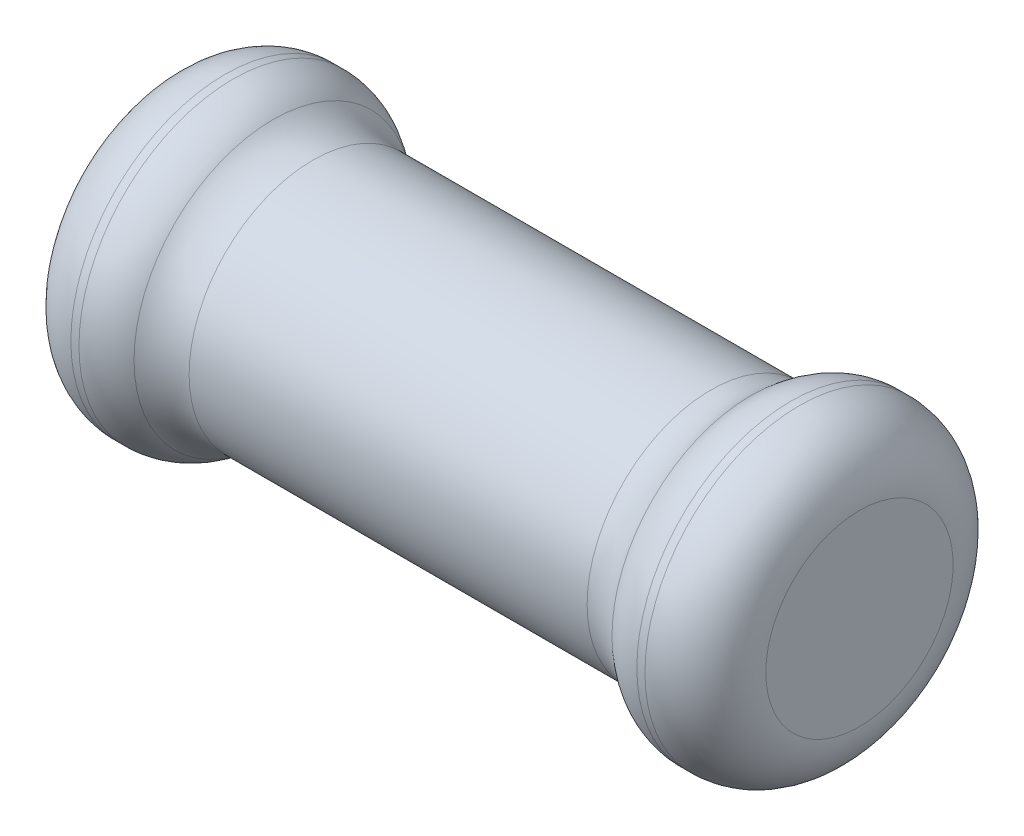
ISO-10303-21;
HEADER;
FILE_DESCRIPTION(('STEP AP214'),'2;1');
FILE_NAME('part.step','',(''),(''),'','','');
FILE_SCHEMA(('AUTOMOTIVE_DESIGN { 1 0 10303 214 1 1 1 1 }'));
ENDSEC;
DATA;
#1=APPLICATION_CONTEXT('core data for automotive mechanical design processes');
#2=APPLICATION_PROTOCOL_DEFINITION('international standard','automotive_design',2000,#1);
#3=PRODUCT_CONTEXT('',#1,'mechanical');
#4=PRODUCT('Part','Part','',(#3));
#5=PRODUCT_RELATED_PRODUCT_CATEGORY('part','',(#4));
#6=PRODUCT_DEFINITION_FORMATION('','',#4);
#7=PRODUCT_DEFINITION_CONTEXT('part definition',#1,'design');
#8=PRODUCT_DEFINITION('design','',#6,#7);
#9=PRODUCT_DEFINITION_SHAPE('','',#8);
#10=(LENGTH_UNIT() NAMED_UNIT(*) SI_UNIT(.MILLI.,.METRE.));
#11=(NAMED_UNIT(*) PLANE_ANGLE_UNIT() SI_UNIT($,.RADIAN.));
#12=(NAMED_UNIT(*) SI_UNIT($,.STERADIAN.) SOLID_ANGLE_UNIT());
#13=UNCERTAINTY_MEASURE_WITH_UNIT(LENGTH_MEASURE(1.E-05),#10,'distance_accuracy_value','');
#14=(GEOMETRIC_REPRESENTATION_CONTEXT(3) GLOBAL_UNCERTAINTY_ASSIGNED_CONTEXT((#13)) GLOBAL_UNIT_ASSIGNED_CONTEXT((#10,
#11,#12)) REPRESENTATION_CONTEXT('',''));
#15=CARTESIAN_POINT('',(0.,0.,0.));
#16=DIRECTION('',(0.,0.,1.));
#17=DIRECTION('',(1.,0.,0.));
#18=AXIS2_PLACEMENT_3D('',#15,#16,#17);
#19=CARTESIAN_POINT('',(5.75,0.,0.));
#20=DIRECTION('',(1.,0.,0.));
#21=DIRECTION('',(0.,1.,0.));
#22=AXIS2_PLACEMENT_3D('',#19,#20,#21);
#23=PLANE('',#22);
#24=CARTESIAN_POINT('',(5.75,0.,0.));
#25=DIRECTION('',(-1.,0.,0.));
#26=DIRECTION('',(0.,-1.,0.));
#27=AXIS2_PLACEMENT_3D('',#24,#25,#26);
#28=CIRCLE('',#27,1.55);
#29=CARTESIAN_POINT('',(5.75,1.55,0.));
#30=VERTEX_POINT('',#29);
#31=CARTESIAN_POINT('',(5.75,0.,1.55));
#32=VERTEX_POINT('',#31);
#33=EDGE_CURVE('E199',#30,#32,#28,.T.);
#34=ORIENTED_EDGE('',*,*,#33,.F.);
#35=CARTESIAN_POINT('',(5.75,0.,0.));
#36=DIRECTION('',(-1.,0.,0.));
#37=DIRECTION('',(0.,-1.,0.));
#38=AXIS2_PLACEMENT_3D('',#35,#36,#37);
#39=CIRCLE('',#38,1.55);
#40=EDGE_CURVE('E10',#32,#30,#39,.T.);
#41=ORIENTED_EDGE('',*,*,#40,.F.);
#42=EDGE_LOOP('',(#34,#41));
#43=FACE_BOUND('',#42,.T.);
#44=ADVANCED_FACE('F16',(#43),#23,.T.);
#45=CARTESIAN_POINT('',(4.75,0.,0.));
#46=DIRECTION('',(1.,0.,0.));
#47=DIRECTION('',(0.,0.,-1.));
#48=AXIS2_PLACEMENT_3D('',#45,#46,#47);
#49=TOROIDAL_SURFACE('',#48,1.55,1.);
#50=ORIENTED_EDGE('',*,*,#33,.T.);
#51=CARTESIAN_POINT('',(4.75,0.,1.55));
#52=DIRECTION('',(0.,-1.,0.));
#53=DIRECTION('',(0.,0.,1.));
#54=AXIS2_PLACEMENT_3D('',#51,#52,#53);
#55=CIRCLE('',#54,1.);
#56=CARTESIAN_POINT('',(4.75,0.,2.55));
#57=VERTEX_POINT('',#56);
#58=EDGE_CURVE('E26',#32,#57,#55,.T.);
#59=ORIENTED_EDGE('',*,*,#58,.T.);
#60=CARTESIAN_POINT('',(4.75,0.,0.));
#61=DIRECTION('',(1.,0.,0.));
#62=DIRECTION('',(0.,-1.,0.));
#63=AXIS2_PLACEMENT_3D('',#60,#61,#62);
#64=CIRCLE('',#63,2.55);
#65=CARTESIAN_POINT('',(4.75,-2.55,0.));
#66=VERTEX_POINT('',#65);
#67=EDGE_CURVE('E193',#57,#66,#64,.T.);
#68=ORIENTED_EDGE('',*,*,#67,.T.);
#69=CARTESIAN_POINT('',(4.75,0.,0.));
#70=DIRECTION('',(1.,0.,0.));
#71=DIRECTION('',(0.,-1.,0.));
#72=AXIS2_PLACEMENT_3D('',#69,#70,#71);
#73=CIRCLE('',#72,2.55);
#74=CARTESIAN_POINT('',(4.75,2.55,0.));
#75=VERTEX_POINT('',#74);
#76=EDGE_CURVE('E185',#66,#75,#73,.T.);
#77=ORIENTED_EDGE('',*,*,#76,.T.);
#78=CARTESIAN_POINT('',(4.75,0.,0.));
#79=DIRECTION('',(1.,0.,0.));
#80=DIRECTION('',(0.,-1.,0.));
#81=AXIS2_PLACEMENT_3D('',#78,#79,#80);
#82=CIRCLE('',#81,2.55);
#83=EDGE_CURVE('E181',#75,#57,#82,.T.);
#84=ORIENTED_EDGE('',*,*,#83,.T.);
#85=ORIENTED_EDGE('',*,*,#58,.F.);
#86=ORIENTED_EDGE('',*,*,#40,.T.);
#87=EDGE_LOOP('',(#50,#59,#68,#77,#84,#85,#86));
#88=FACE_BOUND('',#87,.T.);
#89=ADVANCED_FACE('F256',(#88),#49,.T.);
#90=CARTESIAN_POINT('',(4.75,0.,0.));
#91=DIRECTION('',(1.,0.,0.));
#92=DIRECTION('',(0.,1.,0.));
#93=AXIS2_PLACEMENT_3D('',#90,#91,#92);
#94=CYLINDRICAL_SURFACE('',#93,2.55);
#95=ORIENTED_EDGE('',*,*,#83,.F.);
#96=ORIENTED_EDGE('',*,*,#76,.F.);
#97=DIRECTION('',(-1.,0.,0.));
#98=VECTOR('',#97,1.);
#99=CARTESIAN_POINT('',(4.75,-2.55,0.));
#100=LINE('',#99,#98);
#101=CARTESIAN_POINT('',(4.616025403784,-2.55,0.));
#102=VERTEX_POINT('',#101);
#103=EDGE_CURVE('E190',#66,#102,#100,.T.);
#104=ORIENTED_EDGE('',*,*,#103,.T.);
#105=CARTESIAN_POINT('',(4.616025403784,0.,0.));
#106=DIRECTION('',(-1.,0.,0.));
#107=DIRECTION('',(0.,1.,0.));
#108=AXIS2_PLACEMENT_3D('',#105,#106,#107);
#109=CIRCLE('',#108,2.55);
#110=EDGE_CURVE('E171',#102,#102,#109,.T.);
#111=ORIENTED_EDGE('',*,*,#110,.F.);
#112=ORIENTED_EDGE('',*,*,#103,.F.);
#113=ORIENTED_EDGE('',*,*,#67,.F.);
#114=EDGE_LOOP('',(#95,#96,#104,#111,#112,#113));
#115=FACE_BOUND('',#114,.T.);
#116=ADVANCED_FACE('F261',(#115),#94,.T.);
#117=CARTESIAN_POINT('',(4.616025403784,0.,0.));
#118=DIRECTION('',(1.,0.,0.));
#119=DIRECTION('',(0.,1.,0.));
#120=AXIS2_PLACEMENT_3D('',#117,#118,#119);
#121=TOROIDAL_SURFACE('',#120,1.55,1.);
#122=ORIENTED_EDGE('',*,*,#110,.T.);
#123=CARTESIAN_POINT('',(4.616025403784,-1.55,0.));
#124=DIRECTION('',(0.,0.,-1.));
#125=DIRECTION('',(0.,-1.,0.));
#126=AXIS2_PLACEMENT_3D('',#123,#124,#125);
#127=CIRCLE('',#126,1.);
#128=CARTESIAN_POINT('',(3.954587576018,-2.3,0.));
#129=VERTEX_POINT('',#128);
#130=EDGE_CURVE('E108',#102,#129,#127,.T.);
#131=ORIENTED_EDGE('',*,*,#130,.T.);
#132=CARTESIAN_POINT('',(3.954587576018,0.,0.));
#133=DIRECTION('',(-1.,0.,0.));
#134=DIRECTION('',(0.,1.,0.));
#135=AXIS2_PLACEMENT_3D('',#132,#133,#134);
#136=CIRCLE('',#135,2.3);
#137=CARTESIAN_POINT('',(3.954587576018,0.,2.3));
#138=VERTEX_POINT('',#137);
#139=EDGE_CURVE('E189',#138,#129,#136,.T.);
#140=ORIENTED_EDGE('',*,*,#139,.F.);
#141=CARTESIAN_POINT('',(3.954587576018,0.,0.));
#142=DIRECTION('',(-1.,0.,0.));
#143=DIRECTION('',(0.,1.,0.));
#144=AXIS2_PLACEMENT_3D('',#141,#142,#143);
#145=CIRCLE('',#144,2.3);
#146=EDGE_CURVE('E120',#129,#138,#145,.T.);
#147=ORIENTED_EDGE('',*,*,#146,.F.);
#148=ORIENTED_EDGE('',*,*,#130,.F.);
#149=EDGE_LOOP('',(#122,#131,#140,#147,#148));
#150=FACE_BOUND('',#149,.T.);
#151=ADVANCED_FACE('F271',(#150),#121,.T.);
#152=CARTESIAN_POINT('',(-4.616025403784,0.,0.));
#153=DIRECTION('',(-1.,0.,0.));
#154=DIRECTION('',(0.,1.,0.));
#155=AXIS2_PLACEMENT_3D('',#152,#153,#154);
#156=TOROIDAL_SURFACE('',#155,1.55,1.);
#157=CARTESIAN_POINT('',(-4.616025403784,0.,0.));
#158=DIRECTION('',(1.,0.,0.));
#159=DIRECTION('',(0.,1.,0.));
#160=AXIS2_PLACEMENT_3D('',#157,#158,#159);
#161=CIRCLE('',#160,2.55);
#162=CARTESIAN_POINT('',(-4.616025403784,-2.55,0.));
#163=VERTEX_POINT('',#162);
#164=EDGE_CURVE('E226',#163,#163,#161,.T.);
#165=ORIENTED_EDGE('',*,*,#164,.T.);
#166=CARTESIAN_POINT('',(-4.616025403784,-1.55,0.));
#167=DIRECTION('',(0.,0.,1.));
#168=DIRECTION('',(0.,-1.,0.));
#169=AXIS2_PLACEMENT_3D('',#166,#167,#168);
#170=CIRCLE('',#169,1.);
#171=CARTESIAN_POINT('',(-3.954587576018,-2.3,0.));
#172=VERTEX_POINT('',#171);
#173=EDGE_CURVE('E174',#163,#172,#170,.T.);
#174=ORIENTED_EDGE('',*,*,#173,.T.);
#175=CARTESIAN_POINT('',(-3.954587576018,0.,0.));
#176=DIRECTION('',(1.,0.,0.));
#177=DIRECTION('',(0.,-1.,0.));
#178=AXIS2_PLACEMENT_3D('',#175,#176,#177);
#179=CIRCLE('',#178,2.3);
#180=CARTESIAN_POINT('',(-3.954587576018,0.,2.3));
#181=VERTEX_POINT('',#180);
#182=EDGE_CURVE('E147',#181,#172,#179,.T.);
#183=ORIENTED_EDGE('',*,*,#182,.F.);
#184=CARTESIAN_POINT('',(-3.954587576018,0.,0.));
#185=DIRECTION('',(1.,0.,0.));
#186=DIRECTION('',(0.,-1.,0.));
#187=AXIS2_PLACEMENT_3D('',#184,#185,#186);
#188=CIRCLE('',#187,2.3);
#189=CARTESIAN_POINT('',(-3.954587576018,2.3,0.));
#190=VERTEX_POINT('',#189);
#191=EDGE_CURVE('E145',#190,#181,#188,.T.);
#192=ORIENTED_EDGE('',*,*,#191,.F.);
#193=CARTESIAN_POINT('',(-3.954587576018,0.,0.));
#194=DIRECTION('',(1.,0.,0.));
#195=DIRECTION('',(0.,-1.,0.));
#196=AXIS2_PLACEMENT_3D('',#193,#194,#195);
#197=CIRCLE('',#196,2.3);
#198=EDGE_CURVE('E142',#172,#190,#197,.T.);
#199=ORIENTED_EDGE('',*,*,#198,.F.);
#200=ORIENTED_EDGE('',*,*,#173,.F.);
#201=EDGE_LOOP('',(#165,#174,#183,#192,#199,#200));
#202=FACE_BOUND('',#201,.T.);
#203=ADVANCED_FACE('F154',(#202),#156,.T.);
#204=CARTESIAN_POINT('',(-5.75,2.55,0.));
#205=DIRECTION('',(-1.,0.,0.));
#206=DIRECTION('',(0.,0.,1.));
#207=AXIS2_PLACEMENT_3D('',#204,#205,#206);
#208=PLANE('',#207);
#209=CARTESIAN_POINT('',(-5.75,0.,0.));
#210=DIRECTION('',(1.,0.,0.));
#211=DIRECTION('',(0.,-1.,0.));
#212=AXIS2_PLACEMENT_3D('',#209,#210,#211);
#213=CIRCLE('',#212,1.55);
#214=CARTESIAN_POINT('',(-5.75,1.55,0.));
#215=VERTEX_POINT('',#214);
#216=CARTESIAN_POINT('',(-5.75,0.,1.55));
#217=VERTEX_POINT('',#216);
#218=EDGE_CURVE('E205',#215,#217,#213,.T.);
#219=ORIENTED_EDGE('',*,*,#218,.F.);
#220=CARTESIAN_POINT('',(-5.75,0.,0.));
#221=DIRECTION('',(1.,0.,0.));
#222=DIRECTION('',(0.,-1.,0.));
#223=AXIS2_PLACEMENT_3D('',#220,#221,#222);
#224=CIRCLE('',#223,1.55);
#225=EDGE_CURVE('E179',#217,#215,#224,.T.);
#226=ORIENTED_EDGE('',*,*,#225,.F.);
#227=EDGE_LOOP('',(#219,#226));
#228=FACE_BOUND('',#227,.T.);
#229=ADVANCED_FACE('F275',(#228),#208,.T.);
#230=CARTESIAN_POINT('',(-4.75,0.,0.));
#231=DIRECTION('',(1.,0.,0.));
#232=DIRECTION('',(0.,1.,0.));
#233=AXIS2_PLACEMENT_3D('',#230,#231,#232);
#234=CYLINDRICAL_SURFACE('',#233,2.55);
#235=ORIENTED_EDGE('',*,*,#164,.F.);
#236=DIRECTION('',(-1.,0.,0.));
#237=VECTOR('',#236,1.);
#238=CARTESIAN_POINT('',(-4.75,-2.55,0.));
#239=LINE('',#238,#237);
#240=CARTESIAN_POINT('',(-4.75,-2.55,0.));
#241=VERTEX_POINT('',#240);
#242=EDGE_CURVE('E97',#163,#241,#239,.T.);
#243=ORIENTED_EDGE('',*,*,#242,.T.);
#244=CARTESIAN_POINT('',(-4.75,0.,0.));
#245=DIRECTION('',(-1.,0.,0.));
#246=DIRECTION('',(0.,-1.,0.));
#247=AXIS2_PLACEMENT_3D('',#244,#245,#246);
#248=CIRCLE('',#247,2.55);
#249=CARTESIAN_POINT('',(-4.75,2.55,0.));
#250=VERTEX_POINT('',#249);
#251=EDGE_CURVE('E151',#250,#241,#248,.T.);
#252=ORIENTED_EDGE('',*,*,#251,.F.);
#253=CARTESIAN_POINT('',(-4.75,0.,0.));
#254=DIRECTION('',(-1.,0.,0.));
#255=DIRECTION('',(0.,-1.,0.));
#256=AXIS2_PLACEMENT_3D('',#253,#254,#255);
#257=CIRCLE('',#256,2.55);
#258=CARTESIAN_POINT('',(-4.75,0.,2.55));
#259=VERTEX_POINT('',#258);
#260=EDGE_CURVE('E87',#259,#250,#257,.T.);
#261=ORIENTED_EDGE('',*,*,#260,.F.);
#262=CARTESIAN_POINT('',(-4.75,0.,0.));
#263=DIRECTION('',(-1.,0.,0.));
#264=DIRECTION('',(0.,-1.,0.));
#265=AXIS2_PLACEMENT_3D('',#262,#263,#264);
#266=CIRCLE('',#265,2.55);
#267=EDGE_CURVE('E180',#241,#259,#266,.T.);
#268=ORIENTED_EDGE('',*,*,#267,.F.);
#269=ORIENTED_EDGE('',*,*,#242,.F.);
#270=EDGE_LOOP('',(#235,#243,#252,#261,#268,#269));
#271=FACE_BOUND('',#270,.T.);
#272=ADVANCED_FACE('F241',(#271),#234,.T.);
#273=CARTESIAN_POINT('',(-4.75,0.,0.));
#274=DIRECTION('',(1.,0.,0.));
#275=DIRECTION('',(0.,0.,-1.));
#276=AXIS2_PLACEMENT_3D('',#273,#274,#275);
#277=TOROIDAL_SURFACE('',#276,1.55,1.);
#278=ORIENTED_EDGE('',*,*,#251,.T.);
#279=ORIENTED_EDGE('',*,*,#267,.T.);
#280=CARTESIAN_POINT('',(-4.75,0.,1.55));
#281=DIRECTION('',(0.,-1.,0.));
#282=DIRECTION('',(0.,0.,1.));
#283=AXIS2_PLACEMENT_3D('',#280,#281,#282);
#284=CIRCLE('',#283,1.);
#285=EDGE_CURVE('E175',#259,#217,#284,.T.);
#286=ORIENTED_EDGE('',*,*,#285,.T.);
#287=ORIENTED_EDGE('',*,*,#225,.T.);
#288=ORIENTED_EDGE('',*,*,#218,.T.);
#289=ORIENTED_EDGE('',*,*,#285,.F.);
#290=ORIENTED_EDGE('',*,*,#260,.T.);
#291=EDGE_LOOP('',(#278,#279,#286,#287,#288,#289,#290));
#292=FACE_BOUND('',#291,.T.);
#293=ADVANCED_FACE('F240',(#292),#277,.T.);
#294=CARTESIAN_POINT('',(-3.293149748252,0.,0.));
#295=DIRECTION('',(1.,0.,0.));
#296=DIRECTION('',(0.,0.,-1.));
#297=AXIS2_PLACEMENT_3D('',#294,#295,#296);
#298=TOROIDAL_SURFACE('',#297,3.05,1.);
#299=ORIENTED_EDGE('',*,*,#191,.T.);
#300=CARTESIAN_POINT('',(-3.293149748252,0.,3.05));
#301=DIRECTION('',(0.,-1.,0.));
#302=DIRECTION('',(0.,0.,1.));
#303=AXIS2_PLACEMENT_3D('',#300,#301,#302);
#304=CIRCLE('',#303,1.);
#305=CARTESIAN_POINT('',(-3.293149748252,0.,2.05));
#306=VERTEX_POINT('',#305);
#307=EDGE_CURVE('E156',#181,#306,#304,.T.);
#308=ORIENTED_EDGE('',*,*,#307,.T.);
#309=CARTESIAN_POINT('',(-3.293149748252,0.,0.));
#310=DIRECTION('',(-1.,0.,0.));
#311=DIRECTION('',(0.,-1.,0.));
#312=AXIS2_PLACEMENT_3D('',#309,#310,#311);
#313=CIRCLE('',#312,2.05);
#314=CARTESIAN_POINT('',(-3.293149748252,2.05,0.));
#315=VERTEX_POINT('',#314);
#316=EDGE_CURVE('E19',#306,#315,#313,.T.);
#317=ORIENTED_EDGE('',*,*,#316,.T.);
#318=CARTESIAN_POINT('',(-3.293149748252,0.,0.));
#319=DIRECTION('',(-1.,0.,0.));
#320=DIRECTION('',(0.,-1.,0.));
#321=AXIS2_PLACEMENT_3D('',#318,#319,#320);
#322=CIRCLE('',#321,2.05);
#323=CARTESIAN_POINT('',(-3.293149748252,-2.05,0.));
#324=VERTEX_POINT('',#323);
#325=EDGE_CURVE('E208',#315,#324,#322,.T.);
#326=ORIENTED_EDGE('',*,*,#325,.T.);
#327=CARTESIAN_POINT('',(-3.293149748252,0.,0.));
#328=DIRECTION('',(-1.,0.,0.));
#329=DIRECTION('',(0.,-1.,0.));
#330=AXIS2_PLACEMENT_3D('',#327,#328,#329);
#331=CIRCLE('',#330,2.05);
#332=EDGE_CURVE('E157',#324,#306,#331,.T.);
#333=ORIENTED_EDGE('',*,*,#332,.T.);
#334=ORIENTED_EDGE('',*,*,#307,.F.);
#335=ORIENTED_EDGE('',*,*,#182,.T.);
#336=ORIENTED_EDGE('',*,*,#198,.T.);
#337=EDGE_LOOP('',(#299,#308,#317,#326,#333,#334,#335,#336));
#338=FACE_BOUND('',#337,.T.);
#339=ADVANCED_FACE('F144',(#338),#298,.F.);
#340=CARTESIAN_POINT('',(0.85,0.,0.));
#341=DIRECTION('',(1.,0.,0.));
#342=DIRECTION('',(0.,1.,0.));
#343=AXIS2_PLACEMENT_3D('',#340,#341,#342);
#344=CYLINDRICAL_SURFACE('',#343,2.05);
#345=CARTESIAN_POINT('',(3.293149748252,0.,0.));
#346=DIRECTION('',(1.,0.,0.));
#347=DIRECTION('',(0.,1.,0.));
#348=AXIS2_PLACEMENT_3D('',#345,#346,#347);
#349=CIRCLE('',#348,2.05);
#350=CARTESIAN_POINT('',(3.293149748252,-2.05,0.));
#351=VERTEX_POINT('',#350);
#352=CARTESIAN_POINT('',(3.293149748252,0.,2.05));
#353=VERTEX_POINT('',#352);
#354=EDGE_CURVE('E216',#351,#353,#349,.T.);
#355=ORIENTED_EDGE('',*,*,#354,.F.);
#356=DIRECTION('',(-1.,0.,0.));
#357=VECTOR('',#356,1.);
#358=CARTESIAN_POINT('',(0.85,-2.05,0.));
#359=LINE('',#358,#357);
#360=EDGE_CURVE('E169',#351,#324,#359,.T.);
#361=ORIENTED_EDGE('',*,*,#360,.T.);
#362=ORIENTED_EDGE('',*,*,#325,.F.);
#363=ORIENTED_EDGE('',*,*,#316,.F.);
#364=ORIENTED_EDGE('',*,*,#332,.F.);
#365=ORIENTED_EDGE('',*,*,#360,.F.);
#366=CARTESIAN_POINT('',(3.293149748252,0.,0.));
#367=DIRECTION('',(1.,0.,0.));
#368=DIRECTION('',(0.,1.,0.));
#369=AXIS2_PLACEMENT_3D('',#366,#367,#368);
#370=CIRCLE('',#369,2.05);
#371=EDGE_CURVE('E188',#353,#351,#370,.T.);
#372=ORIENTED_EDGE('',*,*,#371,.F.);
#373=EDGE_LOOP('',(#355,#361,#362,#363,#364,#365,#372));
#374=FACE_BOUND('',#373,.T.);
#375=ADVANCED_FACE('F293',(#374),#344,.T.);
#376=CARTESIAN_POINT('',(3.293149748252,0.,0.));
#377=DIRECTION('',(1.,0.,0.));
#378=DIRECTION('',(0.,0.,-1.));
#379=AXIS2_PLACEMENT_3D('',#376,#377,#378);
#380=TOROIDAL_SURFACE('',#379,3.05,1.);
#381=ORIENTED_EDGE('',*,*,#354,.T.);
#382=CARTESIAN_POINT('',(3.293149748252,0.,3.05));
#383=DIRECTION('',(0.,-1.,0.));
#384=DIRECTION('',(0.,0.,1.));
#385=AXIS2_PLACEMENT_3D('',#382,#383,#384);
#386=CIRCLE('',#385,1.);
#387=EDGE_CURVE('E220',#353,#138,#386,.T.);
#388=ORIENTED_EDGE('',*,*,#387,.T.);
#389=ORIENTED_EDGE('',*,*,#139,.T.);
#390=ORIENTED_EDGE('',*,*,#146,.T.);
#391=ORIENTED_EDGE('',*,*,#387,.F.);
#392=ORIENTED_EDGE('',*,*,#371,.T.);
#393=EDGE_LOOP('',(#381,#388,#389,#390,#391,#392));
#394=FACE_BOUND('',#393,.T.);
#395=ADVANCED_FACE('F290',(#394),#380,.F.);
#396=CLOSED_SHELL('',(#44,#89,#116,#151,#203,#229,#272,#293,#339,#375,#395));
#397=MANIFOLD_SOLID_BREP('B1',#396);
#398=ADVANCED_BREP_SHAPE_REPRESENTATION('',(#18,#397),#14);
#399=SHAPE_DEFINITION_REPRESENTATION(#9,#398);
ENDSEC;
END-ISO-10303-21;
